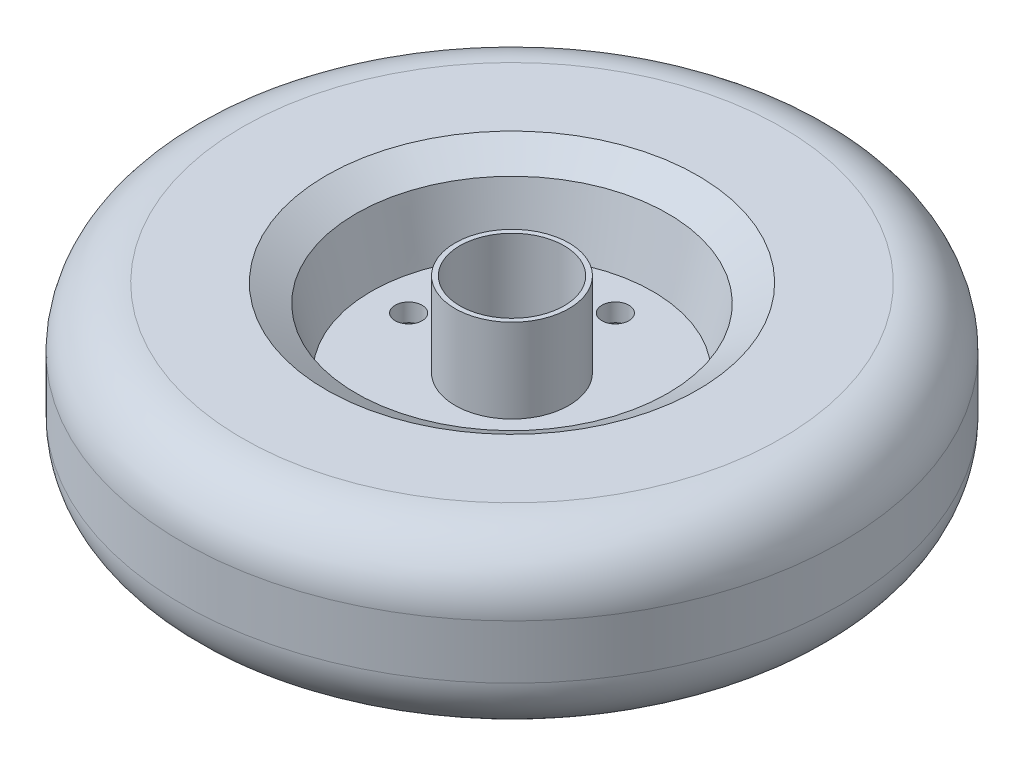
ISO-10303-21;
HEADER;
FILE_DESCRIPTION(('STEP AP214'),'2;1');
FILE_NAME('part.step','',(''),(''),'','','');
FILE_SCHEMA(('AUTOMOTIVE_DESIGN { 1 0 10303 214 1 1 1 1 }'));
ENDSEC;
DATA;
#1=APPLICATION_CONTEXT('core data for automotive mechanical design processes');
#2=APPLICATION_PROTOCOL_DEFINITION('international standard','automotive_design',2000,#1);
#3=PRODUCT_CONTEXT('',#1,'mechanical');
#4=PRODUCT('Part','Part','',(#3));
#5=PRODUCT_RELATED_PRODUCT_CATEGORY('part','',(#4));
#6=PRODUCT_DEFINITION_FORMATION('','',#4);
#7=PRODUCT_DEFINITION_CONTEXT('part definition',#1,'design');
#8=PRODUCT_DEFINITION('design','',#6,#7);
#9=PRODUCT_DEFINITION_SHAPE('','',#8);
#10=(LENGTH_UNIT() NAMED_UNIT(*) SI_UNIT(.MILLI.,.METRE.));
#11=(NAMED_UNIT(*) PLANE_ANGLE_UNIT() SI_UNIT($,.RADIAN.));
#12=(NAMED_UNIT(*) SI_UNIT($,.STERADIAN.) SOLID_ANGLE_UNIT());
#13=UNCERTAINTY_MEASURE_WITH_UNIT(LENGTH_MEASURE(1.E-05),#10,'distance_accuracy_value','');
#14=(GEOMETRIC_REPRESENTATION_CONTEXT(3) GLOBAL_UNCERTAINTY_ASSIGNED_CONTEXT((#13)) GLOBAL_UNIT_ASSIGNED_CONTEXT((#10,
#11,#12)) REPRESENTATION_CONTEXT('',''));
#15=CARTESIAN_POINT('',(0.,0.,0.));
#16=DIRECTION('',(0.,0.,1.));
#17=DIRECTION('',(1.,0.,0.));
#18=AXIS2_PLACEMENT_3D('',#15,#16,#17);
#19=CARTESIAN_POINT('',(0.,8.99999999999999,0.));
#20=DIRECTION('',(0.,1.,0.));
#21=DIRECTION('',(-1.,0.,0.));
#22=AXIS2_PLACEMENT_3D('',#19,#20,#21);
#23=TOROIDAL_SURFACE('',#22,90.,20.);
#24=CARTESIAN_POINT('',(0.,8.99999999999985,0.));
#25=DIRECTION('',(0.,1.,0.));
#26=DIRECTION('',(-1.,0.,0.));
#27=AXIS2_PLACEMENT_3D('',#24,#25,#26);
#28=CIRCLE('',#27,110.);
#29=CARTESIAN_POINT('',(-110.,8.99999999999984,0.));
#30=VERTEX_POINT('',#29);
#31=EDGE_CURVE('E82',#30,#30,#28,.T.);
#32=ORIENTED_EDGE('',*,*,#31,.T.);
#33=EDGE_LOOP('',(#32));
#34=FACE_BOUND('',#33,.T.);
#35=CARTESIAN_POINT('',(0.,29.,0.));
#36=DIRECTION('',(0.,1.,0.));
#37=DIRECTION('',(-1.,0.,0.));
#38=AXIS2_PLACEMENT_3D('',#35,#36,#37);
#39=CIRCLE('',#38,89.9999999999999);
#40=CARTESIAN_POINT('',(-89.9999999999999,29.,0.));
#41=VERTEX_POINT('',#40);
#42=EDGE_CURVE('E10',#41,#41,#39,.T.);
#43=ORIENTED_EDGE('',*,*,#42,.F.);
#44=EDGE_LOOP('',(#43));
#45=FACE_BOUND('',#44,.T.);
#46=ADVANCED_FACE('F36',(#34,#45),#23,.T.);
#47=CARTESIAN_POINT('',(0.,29.,0.));
#48=DIRECTION('',(0.,1.,0.));
#49=DIRECTION('',(-1.,0.,0.));
#50=AXIS2_PLACEMENT_3D('',#47,#48,#49);
#51=PLANE('',#50);
#52=ORIENTED_EDGE('',*,*,#42,.T.);
#53=EDGE_LOOP('',(#52));
#54=FACE_BOUND('',#53,.T.);
#55=CARTESIAN_POINT('',(0.,29.,0.));
#56=DIRECTION('',(0.,1.,0.));
#57=DIRECTION('',(-1.,0.,0.));
#58=AXIS2_PLACEMENT_3D('',#55,#56,#57);
#59=CIRCLE('',#58,62.);
#60=CARTESIAN_POINT('',(-62.,29.,0.));
#61=VERTEX_POINT('',#60);
#62=EDGE_CURVE('E43',#61,#61,#59,.T.);
#63=ORIENTED_EDGE('',*,*,#62,.F.);
#64=EDGE_LOOP('',(#63));
#65=FACE_BOUND('',#64,.T.);
#66=ADVANCED_FACE('F122',(#54,#65),#51,.T.);
#67=CARTESIAN_POINT('',(0.,23.,0.));
#68=DIRECTION('',(0.,1.,0.));
#69=DIRECTION('',(-1.,0.,0.));
#70=AXIS2_PLACEMENT_3D('',#67,#68,#69);
#71=CONICAL_SURFACE('',#70,52.,1.03037682652431);
#72=ORIENTED_EDGE('',*,*,#62,.T.);
#73=EDGE_LOOP('',(#72));
#74=FACE_BOUND('',#73,.T.);
#75=CARTESIAN_POINT('',(0.,23.,0.));
#76=DIRECTION('',(0.,1.,0.));
#77=DIRECTION('',(-1.,0.,0.));
#78=AXIS2_PLACEMENT_3D('',#75,#76,#77);
#79=CIRCLE('',#78,52.);
#80=CARTESIAN_POINT('',(-52.,23.,0.));
#81=VERTEX_POINT('',#80);
#82=EDGE_CURVE('E48',#81,#81,#79,.T.);
#83=ORIENTED_EDGE('',*,*,#82,.F.);
#84=EDGE_LOOP('',(#83));
#85=FACE_BOUND('',#84,.T.);
#86=ADVANCED_FACE('F120',(#74,#85),#71,.F.);
#87=CARTESIAN_POINT('',(0.,2.99999999999998,0.));
#88=DIRECTION('',(0.,1.,0.));
#89=DIRECTION('',(-1.,0.,0.));
#90=AXIS2_PLACEMENT_3D('',#87,#88,#89);
#91=CONICAL_SURFACE('',#90,47.,0.244978663126864);
#92=ORIENTED_EDGE('',*,*,#82,.T.);
#93=EDGE_LOOP('',(#92));
#94=FACE_BOUND('',#93,.T.);
#95=CARTESIAN_POINT('',(0.,2.99999999999998,0.));
#96=DIRECTION('',(0.,1.,0.));
#97=DIRECTION('',(-1.,0.,0.));
#98=AXIS2_PLACEMENT_3D('',#95,#96,#97);
#99=CIRCLE('',#98,47.);
#100=CARTESIAN_POINT('',(-47.,2.99999999999998,0.));
#101=VERTEX_POINT('',#100);
#102=EDGE_CURVE('E112',#101,#101,#99,.T.);
#103=ORIENTED_EDGE('',*,*,#102,.F.);
#104=EDGE_LOOP('',(#103));
#105=FACE_BOUND('',#104,.T.);
#106=ADVANCED_FACE('F117',(#94,#105),#91,.F.);
#107=CARTESIAN_POINT('',(0.,2.99999999999999,0.));
#108=DIRECTION('',(0.,1.,0.));
#109=DIRECTION('',(-1.,0.,0.));
#110=AXIS2_PLACEMENT_3D('',#107,#108,#109);
#111=PLANE('',#110);
#112=CARTESIAN_POINT('',(34.5,2.99999999999999,-3.63254732454092E-13));
#113=DIRECTION('',(0.,1.,0.));
#114=DIRECTION('',(0.,0.,1.));
#115=AXIS2_PLACEMENT_3D('',#112,#113,#114);
#116=CIRCLE('',#115,4.5);
#117=CARTESIAN_POINT('',(34.5,2.99999999999999,4.49999999999964));
#118=VERTEX_POINT('',#117);
#119=EDGE_CURVE('E59',#118,#118,#116,.T.);
#120=ORIENTED_EDGE('',*,*,#119,.F.);
#121=EDGE_LOOP('',(#120));
#122=FACE_BOUND('',#121,.T.);
#123=CARTESIAN_POINT('',(0.,2.99999999999999,34.5));
#124=DIRECTION('',(0.,1.,0.));
#125=DIRECTION('',(0.,0.,1.));
#126=AXIS2_PLACEMENT_3D('',#123,#124,#125);
#127=CIRCLE('',#126,4.5);
#128=CARTESIAN_POINT('',(0.,2.99999999999999,39.));
#129=VERTEX_POINT('',#128);
#130=EDGE_CURVE('E58',#129,#129,#127,.T.);
#131=ORIENTED_EDGE('',*,*,#130,.F.);
#132=EDGE_LOOP('',(#131));
#133=FACE_BOUND('',#132,.T.);
#134=CARTESIAN_POINT('',(-34.5,2.99999999999998,1.22342520073916E-13));
#135=DIRECTION('',(0.,1.,0.));
#136=DIRECTION('',(0.,0.,1.));
#137=AXIS2_PLACEMENT_3D('',#134,#135,#136);
#138=CIRCLE('',#137,4.5);
#139=CARTESIAN_POINT('',(-34.5,2.99999999999998,4.50000000000012));
#140=VERTEX_POINT('',#139);
#141=EDGE_CURVE('E55',#140,#140,#138,.T.);
#142=ORIENTED_EDGE('',*,*,#141,.F.);
#143=EDGE_LOOP('',(#142));
#144=FACE_BOUND('',#143,.T.);
#145=CARTESIAN_POINT('',(0.,2.99999999999999,-34.5));
#146=DIRECTION('',(0.,1.,0.));
#147=DIRECTION('',(0.,0.,1.));
#148=AXIS2_PLACEMENT_3D('',#145,#146,#147);
#149=CIRCLE('',#148,4.5);
#150=CARTESIAN_POINT('',(0.,2.99999999999999,-30.));
#151=VERTEX_POINT('',#150);
#152=EDGE_CURVE('E54',#151,#151,#149,.T.);
#153=ORIENTED_EDGE('',*,*,#152,.F.);
#154=EDGE_LOOP('',(#153));
#155=FACE_BOUND('',#154,.T.);
#156=ORIENTED_EDGE('',*,*,#102,.T.);
#157=EDGE_LOOP('',(#156));
#158=FACE_BOUND('',#157,.T.);
#159=CARTESIAN_POINT('',(0.,2.99999999999999,0.));
#160=DIRECTION('',(0.,1.,0.));
#161=DIRECTION('',(-1.,0.,0.));
#162=AXIS2_PLACEMENT_3D('',#159,#160,#161);
#163=CIRCLE('',#162,19.);
#164=CARTESIAN_POINT('',(-19.,2.99999999999999,0.));
#165=VERTEX_POINT('',#164);
#166=EDGE_CURVE('E109',#165,#165,#163,.T.);
#167=ORIENTED_EDGE('',*,*,#166,.F.);
#168=EDGE_LOOP('',(#167));
#169=FACE_BOUND('',#168,.T.);
#170=ADVANCED_FACE('F129',(#122,#133,#144,#155,#158,#169),#111,.T.);
#171=CARTESIAN_POINT('',(0.,64.7683469018309,0.));
#172=DIRECTION('',(0.,1.,0.));
#173=DIRECTION('',(-1.,0.,0.));
#174=AXIS2_PLACEMENT_3D('',#171,#172,#173);
#175=CYLINDRICAL_SURFACE('',#174,19.);
#176=ORIENTED_EDGE('',*,*,#166,.T.);
#177=EDGE_LOOP('',(#176));
#178=FACE_BOUND('',#177,.T.);
#179=CARTESIAN_POINT('',(0.,31.,0.));
#180=DIRECTION('',(0.,1.,0.));
#181=DIRECTION('',(-1.,0.,0.));
#182=AXIS2_PLACEMENT_3D('',#179,#180,#181);
#183=CIRCLE('',#182,19.);
#184=CARTESIAN_POINT('',(-19.,31.,0.));
#185=VERTEX_POINT('',#184);
#186=EDGE_CURVE('E106',#185,#185,#183,.T.);
#187=ORIENTED_EDGE('',*,*,#186,.F.);
#188=EDGE_LOOP('',(#187));
#189=FACE_BOUND('',#188,.T.);
#190=ADVANCED_FACE('F181',(#178,#189),#175,.T.);
#191=CARTESIAN_POINT('',(0.,31.,0.));
#192=DIRECTION('',(0.,1.,0.));
#193=DIRECTION('',(-1.,0.,0.));
#194=AXIS2_PLACEMENT_3D('',#191,#192,#193);
#195=PLANE('',#194);
#196=CARTESIAN_POINT('',(0.,31.,0.));
#197=DIRECTION('',(0.,1.,0.));
#198=DIRECTION('',(-1.,0.,0.));
#199=AXIS2_PLACEMENT_3D('',#196,#197,#198);
#200=CIRCLE('',#199,17.4);
#201=CARTESIAN_POINT('',(-17.4,31.,0.));
#202=VERTEX_POINT('',#201);
#203=EDGE_CURVE('E70',#202,#202,#200,.T.);
#204=ORIENTED_EDGE('',*,*,#203,.F.);
#205=EDGE_LOOP('',(#204));
#206=FACE_BOUND('',#205,.T.);
#207=ORIENTED_EDGE('',*,*,#186,.T.);
#208=EDGE_LOOP('',(#207));
#209=FACE_BOUND('',#208,.T.);
#210=ADVANCED_FACE('F177',(#206,#209),#195,.T.);
#211=CARTESIAN_POINT('',(0.,-31.,0.));
#212=DIRECTION('',(0.,1.,0.));
#213=DIRECTION('',(-1.,0.,0.));
#214=AXIS2_PLACEMENT_3D('',#211,#212,#213);
#215=PLANE('',#214);
#216=CARTESIAN_POINT('',(0.,-31.,0.));
#217=DIRECTION('',(0.,1.,0.));
#218=DIRECTION('',(-1.,0.,0.));
#219=AXIS2_PLACEMENT_3D('',#216,#217,#218);
#220=CIRCLE('',#219,17.4);
#221=CARTESIAN_POINT('',(-17.4,-31.,0.));
#222=VERTEX_POINT('',#221);
#223=EDGE_CURVE('E39',#222,#222,#220,.T.);
#224=ORIENTED_EDGE('',*,*,#223,.T.);
#225=EDGE_LOOP('',(#224));
#226=FACE_BOUND('',#225,.T.);
#227=CARTESIAN_POINT('',(0.,-31.,0.));
#228=DIRECTION('',(0.,1.,0.));
#229=DIRECTION('',(-1.,0.,0.));
#230=AXIS2_PLACEMENT_3D('',#227,#228,#229);
#231=CIRCLE('',#230,19.);
#232=CARTESIAN_POINT('',(-19.,-31.,0.));
#233=VERTEX_POINT('',#232);
#234=EDGE_CURVE('E103',#233,#233,#231,.T.);
#235=ORIENTED_EDGE('',*,*,#234,.F.);
#236=EDGE_LOOP('',(#235));
#237=FACE_BOUND('',#236,.T.);
#238=ADVANCED_FACE('F173',(#226,#237),#215,.F.);
#239=CARTESIAN_POINT('',(0.,64.7683469018309,0.));
#240=DIRECTION('',(0.,1.,0.));
#241=DIRECTION('',(-1.,0.,0.));
#242=AXIS2_PLACEMENT_3D('',#239,#240,#241);
#243=CYLINDRICAL_SURFACE('',#242,19.);
#244=CARTESIAN_POINT('',(0.,-3.,0.));
#245=DIRECTION('',(0.,1.,0.));
#246=DIRECTION('',(-1.,0.,0.));
#247=AXIS2_PLACEMENT_3D('',#244,#245,#246);
#248=CIRCLE('',#247,19.);
#249=CARTESIAN_POINT('',(-19.,-3.,0.));
#250=VERTEX_POINT('',#249);
#251=EDGE_CURVE('E100',#250,#250,#248,.T.);
#252=ORIENTED_EDGE('',*,*,#251,.F.);
#253=EDGE_LOOP('',(#252));
#254=FACE_BOUND('',#253,.T.);
#255=ORIENTED_EDGE('',*,*,#234,.T.);
#256=EDGE_LOOP('',(#255));
#257=FACE_BOUND('',#256,.T.);
#258=ADVANCED_FACE('F170',(#254,#257),#243,.T.);
#259=CARTESIAN_POINT('',(0.,-3.00000000000001,0.));
#260=DIRECTION('',(0.,1.,0.));
#261=DIRECTION('',(-1.,0.,0.));
#262=AXIS2_PLACEMENT_3D('',#259,#260,#261);
#263=PLANE('',#262);
#264=CARTESIAN_POINT('',(34.5,-3.00000000000001,-3.63254732454092E-13));
#265=DIRECTION('',(0.,1.,0.));
#266=DIRECTION('',(-1.,0.,0.));
#267=AXIS2_PLACEMENT_3D('',#264,#265,#266);
#268=CIRCLE('',#267,4.49999999999999);
#269=CARTESIAN_POINT('',(30.,-3.00000000000001,-3.63254732454092E-13));
#270=VERTEX_POINT('',#269);
#271=EDGE_CURVE('E56',#270,#270,#268,.T.);
#272=ORIENTED_EDGE('',*,*,#271,.T.);
#273=EDGE_LOOP('',(#272));
#274=FACE_BOUND('',#273,.T.);
#275=CARTESIAN_POINT('',(0.,-3.00000000000001,34.5));
#276=DIRECTION('',(0.,1.,0.));
#277=DIRECTION('',(-1.,0.,0.));
#278=AXIS2_PLACEMENT_3D('',#275,#276,#277);
#279=CIRCLE('',#278,4.49999999999999);
#280=CARTESIAN_POINT('',(-4.49999999999999,-3.00000000000001,34.5));
#281=VERTEX_POINT('',#280);
#282=EDGE_CURVE('E63',#281,#281,#279,.T.);
#283=ORIENTED_EDGE('',*,*,#282,.T.);
#284=EDGE_LOOP('',(#283));
#285=FACE_BOUND('',#284,.T.);
#286=CARTESIAN_POINT('',(-34.5,-3.00000000000001,1.22342520073916E-13));
#287=DIRECTION('',(0.,1.,0.));
#288=DIRECTION('',(-1.,0.,0.));
#289=AXIS2_PLACEMENT_3D('',#286,#287,#288);
#290=CIRCLE('',#289,4.49999999999999);
#291=CARTESIAN_POINT('',(-39.,-3.00000000000001,1.22342520073916E-13));
#292=VERTEX_POINT('',#291);
#293=EDGE_CURVE('E52',#292,#292,#290,.T.);
#294=ORIENTED_EDGE('',*,*,#293,.T.);
#295=EDGE_LOOP('',(#294));
#296=FACE_BOUND('',#295,.T.);
#297=CARTESIAN_POINT('',(0.,-3.00000000000001,-34.5));
#298=DIRECTION('',(0.,1.,0.));
#299=DIRECTION('',(-1.,0.,0.));
#300=AXIS2_PLACEMENT_3D('',#297,#298,#299);
#301=CIRCLE('',#300,4.49999999999999);
#302=CARTESIAN_POINT('',(-4.49999999999999,-3.00000000000001,-34.5));
#303=VERTEX_POINT('',#302);
#304=EDGE_CURVE('E79',#303,#303,#301,.T.);
#305=ORIENTED_EDGE('',*,*,#304,.T.);
#306=EDGE_LOOP('',(#305));
#307=FACE_BOUND('',#306,.T.);
#308=CARTESIAN_POINT('',(0.,-3.,0.));
#309=DIRECTION('',(0.,1.,0.));
#310=DIRECTION('',(-1.,0.,0.));
#311=AXIS2_PLACEMENT_3D('',#308,#309,#310);
#312=CIRCLE('',#311,47.);
#313=CARTESIAN_POINT('',(-47.,-3.00000000000001,0.));
#314=VERTEX_POINT('',#313);
#315=EDGE_CURVE('E97',#314,#314,#312,.T.);
#316=ORIENTED_EDGE('',*,*,#315,.F.);
#317=EDGE_LOOP('',(#316));
#318=FACE_BOUND('',#317,.T.);
#319=ORIENTED_EDGE('',*,*,#251,.T.);
#320=EDGE_LOOP('',(#319));
#321=FACE_BOUND('',#320,.T.);
#322=ADVANCED_FACE('F166',(#274,#285,#296,#307,#318,#321),#263,.F.);
#323=CARTESIAN_POINT('',(0.,-3.,0.));
#324=DIRECTION('',(0.,-1.,0.));
#325=DIRECTION('',(1.,0.,0.));
#326=AXIS2_PLACEMENT_3D('',#323,#324,#325);
#327=CONICAL_SURFACE('',#326,47.,0.244978663126863);
#328=CARTESIAN_POINT('',(0.,-23.,0.));
#329=DIRECTION('',(0.,1.,0.));
#330=DIRECTION('',(-1.,0.,0.));
#331=AXIS2_PLACEMENT_3D('',#328,#329,#330);
#332=CIRCLE('',#331,51.9999999999999);
#333=CARTESIAN_POINT('',(-51.9999999999999,-23.,0.));
#334=VERTEX_POINT('',#333);
#335=EDGE_CURVE('E94',#334,#334,#332,.T.);
#336=ORIENTED_EDGE('',*,*,#335,.F.);
#337=EDGE_LOOP('',(#336));
#338=FACE_BOUND('',#337,.T.);
#339=ORIENTED_EDGE('',*,*,#315,.T.);
#340=EDGE_LOOP('',(#339));
#341=FACE_BOUND('',#340,.T.);
#342=ADVANCED_FACE('F162',(#338,#341),#327,.F.);
#343=CARTESIAN_POINT('',(0.,-23.,0.));
#344=DIRECTION('',(0.,-1.,0.));
#345=DIRECTION('',(1.,0.,0.));
#346=AXIS2_PLACEMENT_3D('',#343,#344,#345);
#347=CONICAL_SURFACE('',#346,51.9999999999999,1.03037682652431);
#348=CARTESIAN_POINT('',(0.,-29.,0.));
#349=DIRECTION('',(0.,1.,0.));
#350=DIRECTION('',(-1.,0.,0.));
#351=AXIS2_PLACEMENT_3D('',#348,#349,#350);
#352=CIRCLE('',#351,61.9999999999999);
#353=CARTESIAN_POINT('',(-61.9999999999999,-29.,0.));
#354=VERTEX_POINT('',#353);
#355=EDGE_CURVE('E91',#354,#354,#352,.T.);
#356=ORIENTED_EDGE('',*,*,#355,.F.);
#357=EDGE_LOOP('',(#356));
#358=FACE_BOUND('',#357,.T.);
#359=ORIENTED_EDGE('',*,*,#335,.T.);
#360=EDGE_LOOP('',(#359));
#361=FACE_BOUND('',#360,.T.);
#362=ADVANCED_FACE('F158',(#358,#361),#347,.F.);
#363=CARTESIAN_POINT('',(0.,-29.,0.));
#364=DIRECTION('',(0.,1.,0.));
#365=DIRECTION('',(-1.,0.,0.));
#366=AXIS2_PLACEMENT_3D('',#363,#364,#365);
#367=PLANE('',#366);
#368=CARTESIAN_POINT('',(0.,-29.,0.));
#369=DIRECTION('',(0.,1.,0.));
#370=DIRECTION('',(-1.,0.,0.));
#371=AXIS2_PLACEMENT_3D('',#368,#369,#370);
#372=CIRCLE('',#371,89.9999999999997);
#373=CARTESIAN_POINT('',(-89.9999999999997,-29.,0.));
#374=VERTEX_POINT('',#373);
#375=EDGE_CURVE('E88',#374,#374,#372,.T.);
#376=ORIENTED_EDGE('',*,*,#375,.F.);
#377=EDGE_LOOP('',(#376));
#378=FACE_BOUND('',#377,.T.);
#379=ORIENTED_EDGE('',*,*,#355,.T.);
#380=EDGE_LOOP('',(#379));
#381=FACE_BOUND('',#380,.T.);
#382=ADVANCED_FACE('F151',(#378,#381),#367,.F.);
#383=CARTESIAN_POINT('',(0.,-9.00000000000002,0.));
#384=DIRECTION('',(0.,1.,0.));
#385=DIRECTION('',(-1.,0.,0.));
#386=AXIS2_PLACEMENT_3D('',#383,#384,#385);
#387=TOROIDAL_SURFACE('',#386,89.9999999999999,20.);
#388=CARTESIAN_POINT('',(0.,-8.99999999999988,0.));
#389=DIRECTION('',(0.,1.,0.));
#390=DIRECTION('',(-1.,0.,0.));
#391=AXIS2_PLACEMENT_3D('',#388,#389,#390);
#392=CIRCLE('',#391,110.);
#393=CARTESIAN_POINT('',(-110.,-8.99999999999989,0.));
#394=VERTEX_POINT('',#393);
#395=EDGE_CURVE('E85',#394,#394,#392,.T.);
#396=ORIENTED_EDGE('',*,*,#395,.F.);
#397=EDGE_LOOP('',(#396));
#398=FACE_BOUND('',#397,.T.);
#399=ORIENTED_EDGE('',*,*,#375,.T.);
#400=EDGE_LOOP('',(#399));
#401=FACE_BOUND('',#400,.T.);
#402=ADVANCED_FACE('F141',(#398,#401),#387,.T.);
#403=CARTESIAN_POINT('',(0.,64.7683469018309,0.));
#404=DIRECTION('',(0.,1.,0.));
#405=DIRECTION('',(-1.,0.,0.));
#406=AXIS2_PLACEMENT_3D('',#403,#404,#405);
#407=CYLINDRICAL_SURFACE('',#406,110.);
#408=ORIENTED_EDGE('',*,*,#395,.T.);
#409=EDGE_LOOP('',(#408));
#410=FACE_BOUND('',#409,.T.);
#411=ORIENTED_EDGE('',*,*,#31,.F.);
#412=EDGE_LOOP('',(#411));
#413=FACE_BOUND('',#412,.T.);
#414=ADVANCED_FACE('F138',(#410,#413),#407,.T.);
#415=CARTESIAN_POINT('',(0.,2.99999999999999,-34.5));
#416=DIRECTION('',(0.,1.,0.));
#417=DIRECTION('',(0.,0.,1.));
#418=AXIS2_PLACEMENT_3D('',#415,#416,#417);
#419=CYLINDRICAL_SURFACE('',#418,4.49999999999999);
#420=ORIENTED_EDGE('',*,*,#152,.T.);
#421=EDGE_LOOP('',(#420));
#422=FACE_BOUND('',#421,.T.);
#423=ORIENTED_EDGE('',*,*,#304,.F.);
#424=EDGE_LOOP('',(#423));
#425=FACE_BOUND('',#424,.T.);
#426=ADVANCED_FACE('F140',(#422,#425),#419,.F.);
#427=CARTESIAN_POINT('',(-34.5,2.99999999999998,1.22342520073916E-13));
#428=DIRECTION('',(0.,1.,0.));
#429=DIRECTION('',(0.,0.,1.));
#430=AXIS2_PLACEMENT_3D('',#427,#428,#429);
#431=CYLINDRICAL_SURFACE('',#430,4.49999999999999);
#432=ORIENTED_EDGE('',*,*,#141,.T.);
#433=EDGE_LOOP('',(#432));
#434=FACE_BOUND('',#433,.T.);
#435=ORIENTED_EDGE('',*,*,#293,.F.);
#436=EDGE_LOOP('',(#435));
#437=FACE_BOUND('',#436,.T.);
#438=ADVANCED_FACE('F148',(#434,#437),#431,.F.);
#439=CARTESIAN_POINT('',(0.,2.99999999999999,34.5));
#440=DIRECTION('',(0.,1.,0.));
#441=DIRECTION('',(0.,0.,1.));
#442=AXIS2_PLACEMENT_3D('',#439,#440,#441);
#443=CYLINDRICAL_SURFACE('',#442,4.49999999999999);
#444=ORIENTED_EDGE('',*,*,#130,.T.);
#445=EDGE_LOOP('',(#444));
#446=FACE_BOUND('',#445,.T.);
#447=ORIENTED_EDGE('',*,*,#282,.F.);
#448=EDGE_LOOP('',(#447));
#449=FACE_BOUND('',#448,.T.);
#450=ADVANCED_FACE('F217',(#446,#449),#443,.F.);
#451=CARTESIAN_POINT('',(34.5,2.99999999999999,-3.63254732454092E-13));
#452=DIRECTION('',(0.,1.,0.));
#453=DIRECTION('',(0.,0.,1.));
#454=AXIS2_PLACEMENT_3D('',#451,#452,#453);
#455=CYLINDRICAL_SURFACE('',#454,4.49999999999999);
#456=ORIENTED_EDGE('',*,*,#119,.T.);
#457=EDGE_LOOP('',(#456));
#458=FACE_BOUND('',#457,.T.);
#459=ORIENTED_EDGE('',*,*,#271,.F.);
#460=EDGE_LOOP('',(#459));
#461=FACE_BOUND('',#460,.T.);
#462=ADVANCED_FACE('F223',(#458,#461),#455,.F.);
#463=CARTESIAN_POINT('',(0.,-39.,0.));
#464=DIRECTION('',(0.,1.,0.));
#465=DIRECTION('',(-1.,0.,0.));
#466=AXIS2_PLACEMENT_3D('',#463,#464,#465);
#467=CYLINDRICAL_SURFACE('',#466,17.4);
#468=ORIENTED_EDGE('',*,*,#203,.T.);
#469=EDGE_LOOP('',(#468));
#470=FACE_BOUND('',#469,.T.);
#471=ORIENTED_EDGE('',*,*,#223,.F.);
#472=EDGE_LOOP('',(#471));
#473=FACE_BOUND('',#472,.T.);
#474=ADVANCED_FACE('F229',(#470,#473),#467,.F.);
#475=CLOSED_SHELL('',(#46,#66,#86,#106,#170,#190,#210,#238,#258,#322,#342,#362,#382,#402,#414,
#426,#438,#450,#462,#474));
#476=MANIFOLD_SOLID_BREP('B2',#475);
#477=ADVANCED_BREP_SHAPE_REPRESENTATION('',(#18,#476),#14);
#478=SHAPE_DEFINITION_REPRESENTATION(#9,#477);
ENDSEC;
END-ISO-10303-21;
